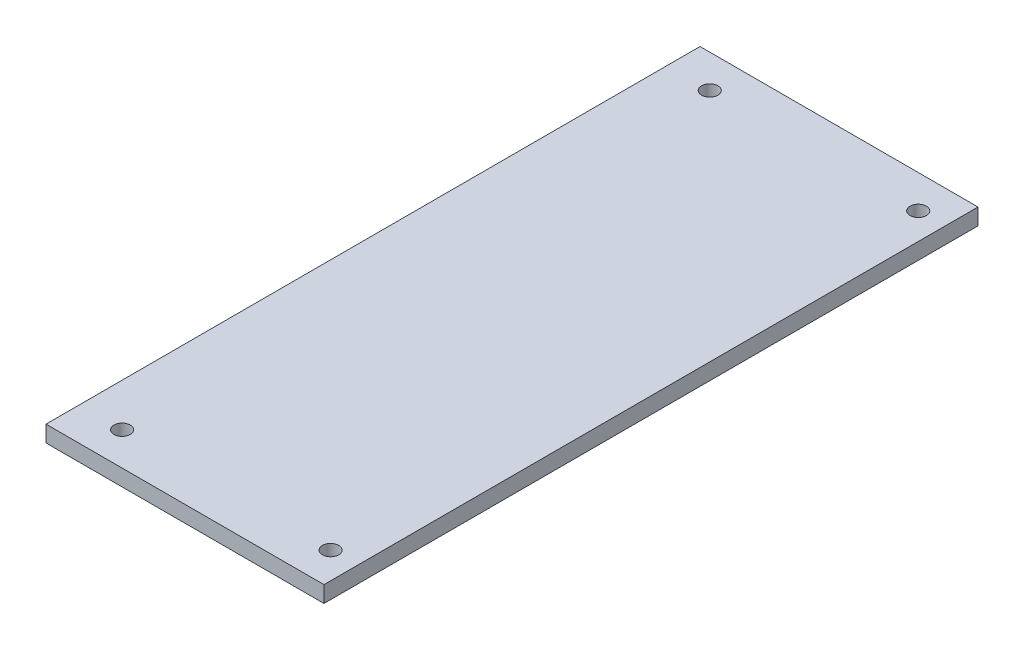
ISO-10303-21;
HEADER;
FILE_DESCRIPTION(('STEP AP214'),'2;1');
FILE_NAME('part.step','',(''),(''),'','','');
FILE_SCHEMA(('AUTOMOTIVE_DESIGN { 1 0 10303 214 1 1 1 1 }'));
ENDSEC;
DATA;
#1=APPLICATION_CONTEXT('core data for automotive mechanical design processes');
#2=APPLICATION_PROTOCOL_DEFINITION('international standard','automotive_design',2000,#1);
#3=PRODUCT_CONTEXT('',#1,'mechanical');
#4=PRODUCT('Part','Part','',(#3));
#5=PRODUCT_RELATED_PRODUCT_CATEGORY('part','',(#4));
#6=PRODUCT_DEFINITION_FORMATION('','',#4);
#7=PRODUCT_DEFINITION_CONTEXT('part definition',#1,'design');
#8=PRODUCT_DEFINITION('design','',#6,#7);
#9=PRODUCT_DEFINITION_SHAPE('','',#8);
#10=(LENGTH_UNIT() NAMED_UNIT(*) SI_UNIT(.MILLI.,.METRE.));
#11=(NAMED_UNIT(*) PLANE_ANGLE_UNIT() SI_UNIT($,.RADIAN.));
#12=(NAMED_UNIT(*) SI_UNIT($,.STERADIAN.) SOLID_ANGLE_UNIT());
#13=UNCERTAINTY_MEASURE_WITH_UNIT(LENGTH_MEASURE(1.E-05),#10,'distance_accuracy_value','');
#14=(GEOMETRIC_REPRESENTATION_CONTEXT(3) GLOBAL_UNCERTAINTY_ASSIGNED_CONTEXT((#13)) GLOBAL_UNIT_ASSIGNED_CONTEXT((#10,
#11,#12)) REPRESENTATION_CONTEXT('',''));
#15=CARTESIAN_POINT('',(0.,0.,0.));
#16=DIRECTION('',(0.,0.,1.));
#17=DIRECTION('',(1.,0.,0.));
#18=AXIS2_PLACEMENT_3D('',#15,#16,#17);
#19=CARTESIAN_POINT('',(-54.9263292373973,5.,-28.9636806637363));
#20=DIRECTION('',(0.,1.,0.));
#21=DIRECTION('',(0.,0.,1.));
#22=AXIS2_PLACEMENT_3D('',#19,#20,#21);
#23=PLANE('',#22);
#24=CARTESIAN_POINT('',(-66.8725070574252,5.,160.885024813504));
#25=DIRECTION('',(0.,-1.,0.));
#26=DIRECTION('',(0.,0.,-1.));
#27=AXIS2_PLACEMENT_3D('',#24,#25,#26);
#28=CIRCLE('',#27,2.5);
#29=CARTESIAN_POINT('',(-66.8725070574252,5.,158.385024813504));
#30=VERTEX_POINT('',#29);
#31=EDGE_CURVE('E109',#30,#30,#28,.T.);
#32=ORIENTED_EDGE('',*,*,#31,.T.);
#33=EDGE_LOOP('',(#32));
#34=FACE_BOUND('',#33,.T.);
#35=CARTESIAN_POINT('',(-66.8725070574253,5.,-18.812386140977));
#36=DIRECTION('',(0.,1.,0.));
#37=DIRECTION('',(0.,0.,1.));
#38=AXIS2_PLACEMENT_3D('',#35,#36,#37);
#39=CIRCLE('',#38,2.50000000000001);
#40=CARTESIAN_POINT('',(-66.8725070574253,5.,-16.3123861409769));
#41=VERTEX_POINT('',#40);
#42=EDGE_CURVE('E113',#41,#41,#39,.T.);
#43=ORIENTED_EDGE('',*,*,#42,.F.);
#44=EDGE_LOOP('',(#43));
#45=FACE_BOUND('',#44,.T.);
#46=DIRECTION('',(0.,0.,1.));
#47=VECTOR('',#46,1.);
#48=CARTESIAN_POINT('',(5.00645732436722,5.,-28.9636806637363));
#49=LINE('',#48,#47);
#50=CARTESIAN_POINT('',(5.00645732436722,5.,-28.9636806637363));
#51=VERTEX_POINT('',#50);
#52=CARTESIAN_POINT('',(5.00645732436722,5.,171.036319336264));
#53=VERTEX_POINT('',#52);
#54=EDGE_CURVE('E127',#51,#53,#49,.T.);
#55=ORIENTED_EDGE('',*,*,#54,.F.);
#56=DIRECTION('',(-1.,0.,0.));
#57=VECTOR('',#56,1.);
#58=CARTESIAN_POINT('',(5.00645732436722,5.,-28.9636806637363));
#59=LINE('',#58,#57);
#60=CARTESIAN_POINT('',(-79.9935426756328,5.,-28.9636806637363));
#61=VERTEX_POINT('',#60);
#62=EDGE_CURVE('E129',#51,#61,#59,.T.);
#63=ORIENTED_EDGE('',*,*,#62,.T.);
#64=DIRECTION('',(0.,0.,-1.));
#65=VECTOR('',#64,1.);
#66=CARTESIAN_POINT('',(-79.9935426756328,5.,-28.9636806637363));
#67=LINE('',#66,#65);
#68=CARTESIAN_POINT('',(-79.9935426756328,5.,171.036319336264));
#69=VERTEX_POINT('',#68);
#70=EDGE_CURVE('E100',#69,#61,#67,.T.);
#71=ORIENTED_EDGE('',*,*,#70,.F.);
#72=DIRECTION('',(-1.,0.,0.));
#73=VECTOR('',#72,1.);
#74=CARTESIAN_POINT('',(5.00645732436722,5.,171.036319336264));
#75=LINE('',#74,#73);
#76=EDGE_CURVE('E50',#53,#69,#75,.T.);
#77=ORIENTED_EDGE('',*,*,#76,.F.);
#78=EDGE_LOOP('',(#55,#63,#71,#77));
#79=FACE_BOUND('',#78,.T.);
#80=CARTESIAN_POINT('',(-3.11457829384024,5.,160.885024813504));
#81=DIRECTION('',(0.,1.,0.));
#82=DIRECTION('',(0.,0.,1.));
#83=AXIS2_PLACEMENT_3D('',#80,#81,#82);
#84=CIRCLE('',#83,2.50000000000001);
#85=CARTESIAN_POINT('',(-3.11457829384024,5.,163.385024813504));
#86=VERTEX_POINT('',#85);
#87=EDGE_CURVE('E114',#86,#86,#84,.T.);
#88=ORIENTED_EDGE('',*,*,#87,.F.);
#89=EDGE_LOOP('',(#88));
#90=FACE_BOUND('',#89,.T.);
#91=CARTESIAN_POINT('',(-3.11457829384029,5.,-18.812386140977));
#92=DIRECTION('',(0.,-1.,0.));
#93=DIRECTION('',(0.,0.,-1.));
#94=AXIS2_PLACEMENT_3D('',#91,#92,#93);
#95=CIRCLE('',#94,2.50000000000001);
#96=CARTESIAN_POINT('',(-3.11457829384029,5.,-21.312386140977));
#97=VERTEX_POINT('',#96);
#98=EDGE_CURVE('E108',#97,#97,#95,.T.);
#99=ORIENTED_EDGE('',*,*,#98,.T.);
#100=EDGE_LOOP('',(#99));
#101=FACE_BOUND('',#100,.T.);
#102=ADVANCED_FACE('F39',(#34,#45,#79,#90,#101),#23,.T.);
#103=CARTESIAN_POINT('',(0.,0.,0.));
#104=DIRECTION('',(0.,1.,0.));
#105=DIRECTION('',(0.,0.,1.));
#106=AXIS2_PLACEMENT_3D('',#103,#104,#105);
#107=PLANE('',#106);
#108=CARTESIAN_POINT('',(-3.11457829384024,0.,160.885024813504));
#109=DIRECTION('',(0.,1.,0.));
#110=DIRECTION('',(0.,0.,1.));
#111=AXIS2_PLACEMENT_3D('',#108,#109,#110);
#112=CIRCLE('',#111,2.50000000000001);
#113=CARTESIAN_POINT('',(-3.11457829384024,0.,163.385024813504));
#114=VERTEX_POINT('',#113);
#115=EDGE_CURVE('E147',#114,#114,#112,.T.);
#116=ORIENTED_EDGE('',*,*,#115,.T.);
#117=EDGE_LOOP('',(#116));
#118=FACE_BOUND('',#117,.T.);
#119=CARTESIAN_POINT('',(-66.8725070574253,0.,-18.812386140977));
#120=DIRECTION('',(0.,1.,0.));
#121=DIRECTION('',(0.,0.,1.));
#122=AXIS2_PLACEMENT_3D('',#119,#120,#121);
#123=CIRCLE('',#122,2.50000000000001);
#124=CARTESIAN_POINT('',(-66.8725070574253,0.,-16.3123861409769));
#125=VERTEX_POINT('',#124);
#126=EDGE_CURVE('E124',#125,#125,#123,.T.);
#127=ORIENTED_EDGE('',*,*,#126,.T.);
#128=EDGE_LOOP('',(#127));
#129=FACE_BOUND('',#128,.T.);
#130=DIRECTION('',(0.,0.,1.));
#131=VECTOR('',#130,1.);
#132=CARTESIAN_POINT('',(5.00645732436722,0.,-28.9636806637363));
#133=LINE('',#132,#131);
#134=CARTESIAN_POINT('',(5.00645732436722,0.,-28.9636806637363));
#135=VERTEX_POINT('',#134);
#136=CARTESIAN_POINT('',(5.00645732436722,0.,171.036319336264));
#137=VERTEX_POINT('',#136);
#138=EDGE_CURVE('E56',#135,#137,#133,.T.);
#139=ORIENTED_EDGE('',*,*,#138,.T.);
#140=DIRECTION('',(-1.,0.,0.));
#141=VECTOR('',#140,1.);
#142=CARTESIAN_POINT('',(5.00645732436722,0.,171.036319336264));
#143=LINE('',#142,#141);
#144=CARTESIAN_POINT('',(-79.9935426756328,0.,171.036319336264));
#145=VERTEX_POINT('',#144);
#146=EDGE_CURVE('E11',#137,#145,#143,.T.);
#147=ORIENTED_EDGE('',*,*,#146,.T.);
#148=DIRECTION('',(0.,0.,1.));
#149=VECTOR('',#148,1.);
#150=CARTESIAN_POINT('',(-79.9935426756328,0.,-28.9636806637363));
#151=LINE('',#150,#149);
#152=CARTESIAN_POINT('',(-79.9935426756328,0.,-28.9636806637363));
#153=VERTEX_POINT('',#152);
#154=EDGE_CURVE('E88',#153,#145,#151,.T.);
#155=ORIENTED_EDGE('',*,*,#154,.F.);
#156=DIRECTION('',(-1.,0.,0.));
#157=VECTOR('',#156,1.);
#158=CARTESIAN_POINT('',(5.00645732436722,0.,-28.9636806637363));
#159=LINE('',#158,#157);
#160=EDGE_CURVE('E78',#135,#153,#159,.T.);
#161=ORIENTED_EDGE('',*,*,#160,.F.);
#162=EDGE_LOOP('',(#139,#147,#155,#161));
#163=FACE_BOUND('',#162,.T.);
#164=CARTESIAN_POINT('',(-66.8725070574252,0.,160.885024813504));
#165=DIRECTION('',(0.,1.,0.));
#166=DIRECTION('',(0.,0.,1.));
#167=AXIS2_PLACEMENT_3D('',#164,#165,#166);
#168=CIRCLE('',#167,2.5);
#169=CARTESIAN_POINT('',(-66.8725070574252,0.,163.385024813504));
#170=VERTEX_POINT('',#169);
#171=EDGE_CURVE('E144',#170,#170,#168,.F.);
#172=ORIENTED_EDGE('',*,*,#171,.F.);
#173=EDGE_LOOP('',(#172));
#174=FACE_BOUND('',#173,.T.);
#175=CARTESIAN_POINT('',(-3.11457829384029,0.,-18.812386140977));
#176=DIRECTION('',(0.,1.,0.));
#177=DIRECTION('',(0.,0.,1.));
#178=AXIS2_PLACEMENT_3D('',#175,#176,#177);
#179=CIRCLE('',#178,2.50000000000001);
#180=CARTESIAN_POINT('',(-3.11457829384029,0.,-16.3123861409769));
#181=VERTEX_POINT('',#180);
#182=EDGE_CURVE('E43',#181,#181,#179,.F.);
#183=ORIENTED_EDGE('',*,*,#182,.F.);
#184=EDGE_LOOP('',(#183));
#185=FACE_BOUND('',#184,.T.);
#186=ADVANCED_FACE('F89',(#118,#129,#163,#174,#185),#107,.F.);
#187=CARTESIAN_POINT('',(5.00645732436722,5.,171.036319336264));
#188=DIRECTION('',(0.,0.,-1.));
#189=DIRECTION('',(1.,0.,0.));
#190=AXIS2_PLACEMENT_3D('',#187,#188,#189);
#191=PLANE('',#190);
#192=DIRECTION('',(0.,-1.,0.));
#193=VECTOR('',#192,1.);
#194=CARTESIAN_POINT('',(5.00645732436722,5.,171.036319336264));
#195=LINE('',#194,#193);
#196=EDGE_CURVE('E85',#53,#137,#195,.T.);
#197=ORIENTED_EDGE('',*,*,#196,.F.);
#198=ORIENTED_EDGE('',*,*,#76,.T.);
#199=DIRECTION('',(0.,1.,0.));
#200=VECTOR('',#199,1.);
#201=CARTESIAN_POINT('',(-79.9935426756328,5.,171.036319336264));
#202=LINE('',#201,#200);
#203=EDGE_CURVE('E95',#145,#69,#202,.T.);
#204=ORIENTED_EDGE('',*,*,#203,.F.);
#205=ORIENTED_EDGE('',*,*,#146,.F.);
#206=EDGE_LOOP('',(#197,#198,#204,#205));
#207=FACE_BOUND('',#206,.T.);
#208=ADVANCED_FACE('F159',(#207),#191,.F.);
#209=CARTESIAN_POINT('',(5.00645732436722,5.,-28.9636806637363));
#210=DIRECTION('',(1.,0.,0.));
#211=DIRECTION('',(0.,0.,-1.));
#212=AXIS2_PLACEMENT_3D('',#209,#210,#211);
#213=PLANE('',#212);
#214=ORIENTED_EDGE('',*,*,#138,.F.);
#215=DIRECTION('',(0.,-1.,0.));
#216=VECTOR('',#215,1.);
#217=CARTESIAN_POINT('',(5.00645732436722,5.,-28.9636806637363));
#218=LINE('',#217,#216);
#219=EDGE_CURVE('E83',#51,#135,#218,.T.);
#220=ORIENTED_EDGE('',*,*,#219,.F.);
#221=ORIENTED_EDGE('',*,*,#54,.T.);
#222=ORIENTED_EDGE('',*,*,#196,.T.);
#223=EDGE_LOOP('',(#214,#220,#221,#222));
#224=FACE_BOUND('',#223,.T.);
#225=ADVANCED_FACE('F165',(#224),#213,.T.);
#226=CARTESIAN_POINT('',(5.00645732436722,5.,-28.9636806637363));
#227=DIRECTION('',(0.,0.,1.));
#228=DIRECTION('',(1.,0.,0.));
#229=AXIS2_PLACEMENT_3D('',#226,#227,#228);
#230=PLANE('',#229);
#231=ORIENTED_EDGE('',*,*,#62,.F.);
#232=ORIENTED_EDGE('',*,*,#219,.T.);
#233=ORIENTED_EDGE('',*,*,#160,.T.);
#234=DIRECTION('',(0.,-1.,0.));
#235=VECTOR('',#234,1.);
#236=CARTESIAN_POINT('',(-79.9935426756328,5.,-28.9636806637363));
#237=LINE('',#236,#235);
#238=EDGE_CURVE('E81',#61,#153,#237,.T.);
#239=ORIENTED_EDGE('',*,*,#238,.F.);
#240=EDGE_LOOP('',(#231,#232,#233,#239));
#241=FACE_BOUND('',#240,.T.);
#242=ADVANCED_FACE('F41',(#241),#230,.F.);
#243=CARTESIAN_POINT('',(-66.8725070574253,-5.,-18.812386140977));
#244=DIRECTION('',(0.,1.,0.));
#245=DIRECTION('',(0.,0.,1.));
#246=AXIS2_PLACEMENT_3D('',#243,#244,#245);
#247=CYLINDRICAL_SURFACE('',#246,2.50000000000001);
#248=ORIENTED_EDGE('',*,*,#42,.T.);
#249=EDGE_LOOP('',(#248));
#250=FACE_BOUND('',#249,.T.);
#251=ORIENTED_EDGE('',*,*,#126,.F.);
#252=EDGE_LOOP('',(#251));
#253=FACE_BOUND('',#252,.T.);
#254=ADVANCED_FACE('F174',(#250,#253),#247,.F.);
#255=CARTESIAN_POINT('',(-66.8725070574252,-5.,160.885024813504));
#256=DIRECTION('',(0.,1.,0.));
#257=DIRECTION('',(0.,0.,1.));
#258=AXIS2_PLACEMENT_3D('',#255,#256,#257);
#259=CYLINDRICAL_SURFACE('',#258,2.5);
#260=ORIENTED_EDGE('',*,*,#31,.F.);
#261=EDGE_LOOP('',(#260));
#262=FACE_BOUND('',#261,.T.);
#263=ORIENTED_EDGE('',*,*,#171,.T.);
#264=EDGE_LOOP('',(#263));
#265=FACE_BOUND('',#264,.T.);
#266=ADVANCED_FACE('F177',(#262,#265),#259,.F.);
#267=CARTESIAN_POINT('',(-3.11457829384024,-5.,160.885024813504));
#268=DIRECTION('',(0.,1.,0.));
#269=DIRECTION('',(0.,0.,1.));
#270=AXIS2_PLACEMENT_3D('',#267,#268,#269);
#271=CYLINDRICAL_SURFACE('',#270,2.50000000000001);
#272=ORIENTED_EDGE('',*,*,#87,.T.);
#273=EDGE_LOOP('',(#272));
#274=FACE_BOUND('',#273,.T.);
#275=ORIENTED_EDGE('',*,*,#115,.F.);
#276=EDGE_LOOP('',(#275));
#277=FACE_BOUND('',#276,.T.);
#278=ADVANCED_FACE('F181',(#274,#277),#271,.F.);
#279=CARTESIAN_POINT('',(-3.11457829384029,-5.,-18.812386140977));
#280=DIRECTION('',(0.,1.,0.));
#281=DIRECTION('',(0.,0.,1.));
#282=AXIS2_PLACEMENT_3D('',#279,#280,#281);
#283=CYLINDRICAL_SURFACE('',#282,2.50000000000001);
#284=ORIENTED_EDGE('',*,*,#98,.F.);
#285=EDGE_LOOP('',(#284));
#286=FACE_BOUND('',#285,.T.);
#287=ORIENTED_EDGE('',*,*,#182,.T.);
#288=EDGE_LOOP('',(#287));
#289=FACE_BOUND('',#288,.T.);
#290=ADVANCED_FACE('F156',(#286,#289),#283,.F.);
#291=CARTESIAN_POINT('',(-79.9935426756328,0.,0.));
#292=DIRECTION('',(-1.,0.,0.));
#293=DIRECTION('',(0.,0.,1.));
#294=AXIS2_PLACEMENT_3D('',#291,#292,#293);
#295=PLANE('',#294);
#296=ORIENTED_EDGE('',*,*,#238,.T.);
#297=ORIENTED_EDGE('',*,*,#154,.T.);
#298=ORIENTED_EDGE('',*,*,#203,.T.);
#299=ORIENTED_EDGE('',*,*,#70,.T.);
#300=EDGE_LOOP('',(#296,#297,#298,#299));
#301=FACE_BOUND('',#300,.T.);
#302=ADVANCED_FACE('F98',(#301),#295,.T.);
#303=CLOSED_SHELL('',(#102,#186,#208,#225,#242,#254,#266,#278,#290,#302));
#304=MANIFOLD_SOLID_BREP('B2',#303);
#305=ADVANCED_BREP_SHAPE_REPRESENTATION('',(#18,#304),#14);
#306=SHAPE_DEFINITION_REPRESENTATION(#9,#305);
ENDSEC;
END-ISO-10303-21;
